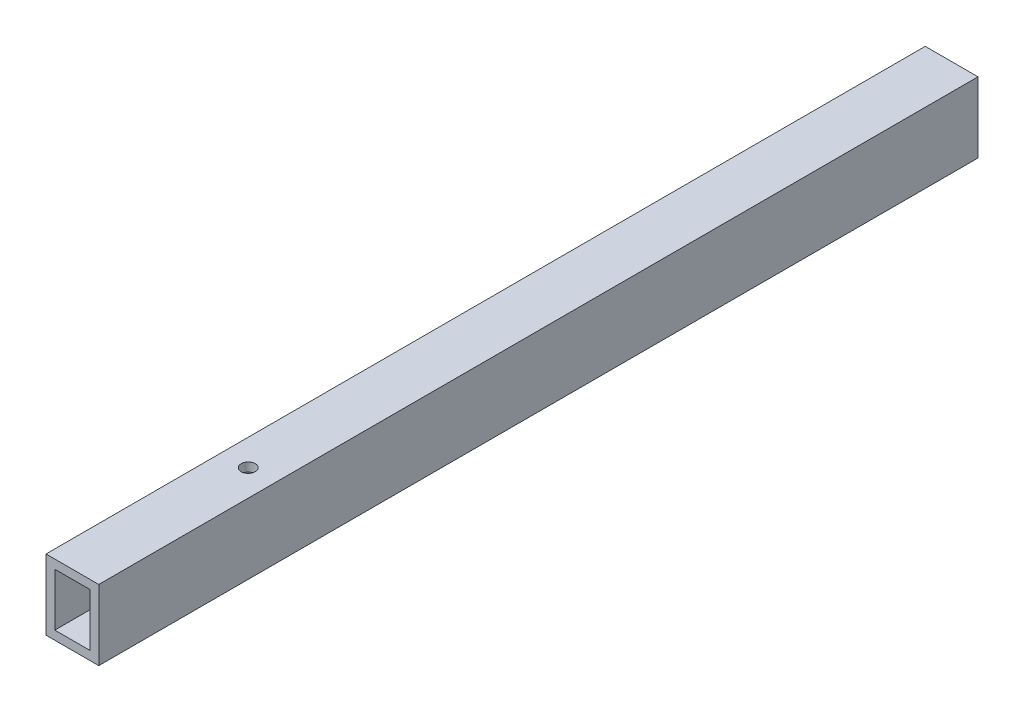
ISO-10303-21;
HEADER;
FILE_DESCRIPTION(('STEP AP214'),'2;1');
FILE_NAME('part.step','',(''),(''),'','','');
FILE_SCHEMA(('AUTOMOTIVE_DESIGN { 1 0 10303 214 1 1 1 1 }'));
ENDSEC;
DATA;
#1=APPLICATION_CONTEXT('core data for automotive mechanical design processes');
#2=APPLICATION_PROTOCOL_DEFINITION('international standard','automotive_design',2000,#1);
#3=PRODUCT_CONTEXT('',#1,'mechanical');
#4=PRODUCT('Part','Part','',(#3));
#5=PRODUCT_RELATED_PRODUCT_CATEGORY('part','',(#4));
#6=PRODUCT_DEFINITION_FORMATION('','',#4);
#7=PRODUCT_DEFINITION_CONTEXT('part definition',#1,'design');
#8=PRODUCT_DEFINITION('design','',#6,#7);
#9=PRODUCT_DEFINITION_SHAPE('','',#8);
#10=(LENGTH_UNIT() NAMED_UNIT(*) SI_UNIT(.MILLI.,.METRE.));
#11=(NAMED_UNIT(*) PLANE_ANGLE_UNIT() SI_UNIT($,.RADIAN.));
#12=(NAMED_UNIT(*) SI_UNIT($,.STERADIAN.) SOLID_ANGLE_UNIT());
#13=UNCERTAINTY_MEASURE_WITH_UNIT(LENGTH_MEASURE(1.E-05),#10,'distance_accuracy_value','');
#14=(GEOMETRIC_REPRESENTATION_CONTEXT(3) GLOBAL_UNCERTAINTY_ASSIGNED_CONTEXT((#13)) GLOBAL_UNIT_ASSIGNED_CONTEXT((#10,
#11,#12)) REPRESENTATION_CONTEXT('',''));
#15=CARTESIAN_POINT('',(0.,0.,0.));
#16=DIRECTION('',(0.,0.,1.));
#17=DIRECTION('',(1.,0.,0.));
#18=AXIS2_PLACEMENT_3D('',#15,#16,#17);
#19=CARTESIAN_POINT('',(0.,0.,-100.));
#20=DIRECTION('',(-1.,0.,0.));
#21=DIRECTION('',(0.,0.,1.));
#22=AXIS2_PLACEMENT_3D('',#19,#20,#21);
#23=PLANE('',#22);
#24=DIRECTION('',(0.,-1.,0.));
#25=VECTOR('',#24,1.);
#26=CARTESIAN_POINT('',(0.,0.,0.));
#27=LINE('',#26,#25);
#28=CARTESIAN_POINT('',(0.,8.,0.));
#29=VERTEX_POINT('',#28);
#30=CARTESIAN_POINT('',(0.,0.,0.));
#31=VERTEX_POINT('',#30);
#32=EDGE_CURVE('E156',#29,#31,#27,.T.);
#33=ORIENTED_EDGE('',*,*,#32,.F.);
#34=DIRECTION('',(0.,0.,1.));
#35=VECTOR('',#34,1.);
#36=CARTESIAN_POINT('',(0.,8.,-100.));
#37=LINE('',#36,#35);
#38=CARTESIAN_POINT('',(0.,8.,-100.));
#39=VERTEX_POINT('',#38);
#40=EDGE_CURVE('E11',#39,#29,#37,.T.);
#41=ORIENTED_EDGE('',*,*,#40,.F.);
#42=DIRECTION('',(0.,-1.,0.));
#43=VECTOR('',#42,1.);
#44=CARTESIAN_POINT('',(0.,0.,-100.));
#45=LINE('',#44,#43);
#46=CARTESIAN_POINT('',(0.,0.,-100.));
#47=VERTEX_POINT('',#46);
#48=EDGE_CURVE('E162',#39,#47,#45,.T.);
#49=ORIENTED_EDGE('',*,*,#48,.T.);
#50=DIRECTION('',(0.,0.,1.));
#51=VECTOR('',#50,1.);
#52=CARTESIAN_POINT('',(0.,0.,-100.));
#53=LINE('',#52,#51);
#54=EDGE_CURVE('E40',#47,#31,#53,.T.);
#55=ORIENTED_EDGE('',*,*,#54,.T.);
#56=EDGE_LOOP('',(#33,#41,#49,#55));
#57=FACE_BOUND('',#56,.T.);
#58=ADVANCED_FACE('F37',(#57),#23,.T.);
#59=CARTESIAN_POINT('',(0.,8.,-100.));
#60=DIRECTION('',(0.,1.,0.));
#61=DIRECTION('',(0.,0.,1.));
#62=AXIS2_PLACEMENT_3D('',#59,#60,#61);
#63=PLANE('',#62);
#64=CARTESIAN_POINT('',(3.,8.,-20.));
#65=DIRECTION('',(0.,1.,0.));
#66=DIRECTION('',(0.,0.,1.));
#67=AXIS2_PLACEMENT_3D('',#64,#65,#66);
#68=CIRCLE('',#67,0.799999999999999);
#69=CARTESIAN_POINT('',(3.,8.,-19.2));
#70=VERTEX_POINT('',#69);
#71=EDGE_CURVE('E120',#70,#70,#68,.T.);
#72=ORIENTED_EDGE('',*,*,#71,.F.);
#73=EDGE_LOOP('',(#72));
#74=FACE_BOUND('',#73,.T.);
#75=DIRECTION('',(-1.,0.,0.));
#76=VECTOR('',#75,1.);
#77=CARTESIAN_POINT('',(0.,8.,0.));
#78=LINE('',#77,#76);
#79=CARTESIAN_POINT('',(6.,8.,0.));
#80=VERTEX_POINT('',#79);
#81=EDGE_CURVE('E165',#80,#29,#78,.T.);
#82=ORIENTED_EDGE('',*,*,#81,.F.);
#83=DIRECTION('',(0.,0.,1.));
#84=VECTOR('',#83,1.);
#85=CARTESIAN_POINT('',(6.,8.,-100.));
#86=LINE('',#85,#84);
#87=CARTESIAN_POINT('',(6.,8.,-100.));
#88=VERTEX_POINT('',#87);
#89=EDGE_CURVE('E45',#88,#80,#86,.T.);
#90=ORIENTED_EDGE('',*,*,#89,.F.);
#91=DIRECTION('',(-1.,0.,0.));
#92=VECTOR('',#91,1.);
#93=CARTESIAN_POINT('',(0.,8.,-100.));
#94=LINE('',#93,#92);
#95=EDGE_CURVE('E170',#88,#39,#94,.T.);
#96=ORIENTED_EDGE('',*,*,#95,.T.);
#97=ORIENTED_EDGE('',*,*,#40,.T.);
#98=EDGE_LOOP('',(#82,#90,#96,#97));
#99=FACE_BOUND('',#98,.T.);
#100=ADVANCED_FACE('F187',(#74,#99),#63,.T.);
#101=CARTESIAN_POINT('',(6.,0.,-100.));
#102=DIRECTION('',(1.,0.,0.));
#103=DIRECTION('',(0.,0.,-1.));
#104=AXIS2_PLACEMENT_3D('',#101,#102,#103);
#105=PLANE('',#104);
#106=DIRECTION('',(0.,1.,0.));
#107=VECTOR('',#106,1.);
#108=CARTESIAN_POINT('',(6.,0.,0.));
#109=LINE('',#108,#107);
#110=CARTESIAN_POINT('',(6.,0.,0.));
#111=VERTEX_POINT('',#110);
#112=EDGE_CURVE('E177',#111,#80,#109,.T.);
#113=ORIENTED_EDGE('',*,*,#112,.F.);
#114=DIRECTION('',(0.,0.,1.));
#115=VECTOR('',#114,1.);
#116=CARTESIAN_POINT('',(6.,0.,-100.));
#117=LINE('',#116,#115);
#118=CARTESIAN_POINT('',(6.,0.,-100.));
#119=VERTEX_POINT('',#118);
#120=EDGE_CURVE('E182',#119,#111,#117,.T.);
#121=ORIENTED_EDGE('',*,*,#120,.F.);
#122=DIRECTION('',(0.,1.,0.));
#123=VECTOR('',#122,1.);
#124=CARTESIAN_POINT('',(6.,0.,-100.));
#125=LINE('',#124,#123);
#126=EDGE_CURVE('E167',#119,#88,#125,.T.);
#127=ORIENTED_EDGE('',*,*,#126,.T.);
#128=ORIENTED_EDGE('',*,*,#89,.T.);
#129=EDGE_LOOP('',(#113,#121,#127,#128));
#130=FACE_BOUND('',#129,.T.);
#131=ADVANCED_FACE('F191',(#130),#105,.T.);
#132=CARTESIAN_POINT('',(0.,0.,-100.));
#133=DIRECTION('',(0.,-1.,0.));
#134=DIRECTION('',(0.,0.,-1.));
#135=AXIS2_PLACEMENT_3D('',#132,#133,#134);
#136=PLANE('',#135);
#137=DIRECTION('',(1.,0.,0.));
#138=VECTOR('',#137,1.);
#139=CARTESIAN_POINT('',(0.,0.,0.));
#140=LINE('',#139,#138);
#141=EDGE_CURVE('E174',#31,#111,#140,.T.);
#142=ORIENTED_EDGE('',*,*,#141,.F.);
#143=ORIENTED_EDGE('',*,*,#54,.F.);
#144=DIRECTION('',(1.,0.,0.));
#145=VECTOR('',#144,1.);
#146=CARTESIAN_POINT('',(0.,0.,-100.));
#147=LINE('',#146,#145);
#148=EDGE_CURVE('E164',#47,#119,#147,.T.);
#149=ORIENTED_EDGE('',*,*,#148,.T.);
#150=ORIENTED_EDGE('',*,*,#120,.T.);
#151=EDGE_LOOP('',(#142,#143,#149,#150));
#152=FACE_BOUND('',#151,.T.);
#153=ADVANCED_FACE('F184',(#152),#136,.T.);
#154=CARTESIAN_POINT('',(0.,0.,-100.));
#155=DIRECTION('',(0.,0.,-1.));
#156=DIRECTION('',(-1.,0.,0.));
#157=AXIS2_PLACEMENT_3D('',#154,#155,#156);
#158=PLANE('',#157);
#159=CARTESIAN_POINT('',(3.,4.,-100.));
#160=DIRECTION('',(0.,0.,-1.));
#161=DIRECTION('',(-1.,0.,0.));
#162=AXIS2_PLACEMENT_3D('',#159,#160,#161);
#163=CIRCLE('',#162,1.25);
#164=CARTESIAN_POINT('',(1.75,4.,-100.));
#165=VERTEX_POINT('',#164);
#166=EDGE_CURVE('E121',#165,#165,#163,.T.);
#167=ORIENTED_EDGE('',*,*,#166,.F.);
#168=EDGE_LOOP('',(#167));
#169=FACE_BOUND('',#168,.T.);
#170=ORIENTED_EDGE('',*,*,#48,.F.);
#171=ORIENTED_EDGE('',*,*,#95,.F.);
#172=ORIENTED_EDGE('',*,*,#126,.F.);
#173=ORIENTED_EDGE('',*,*,#148,.F.);
#174=EDGE_LOOP('',(#170,#171,#172,#173));
#175=FACE_BOUND('',#174,.T.);
#176=ADVANCED_FACE('F193',(#169,#175),#158,.T.);
#177=CARTESIAN_POINT('',(0.,0.,0.));
#178=DIRECTION('',(0.,0.,-1.));
#179=DIRECTION('',(-1.,0.,0.));
#180=AXIS2_PLACEMENT_3D('',#177,#178,#179);
#181=PLANE('',#180);
#182=DIRECTION('',(1.,0.,0.));
#183=VECTOR('',#182,1.);
#184=CARTESIAN_POINT('',(1.,1.,0.));
#185=LINE('',#184,#183);
#186=CARTESIAN_POINT('',(1.,1.,0.));
#187=VERTEX_POINT('',#186);
#188=CARTESIAN_POINT('',(5.,1.,0.));
#189=VERTEX_POINT('',#188);
#190=EDGE_CURVE('E146',#187,#189,#185,.T.);
#191=ORIENTED_EDGE('',*,*,#190,.F.);
#192=DIRECTION('',(0.,-1.,0.));
#193=VECTOR('',#192,1.);
#194=CARTESIAN_POINT('',(1.,7.,0.));
#195=LINE('',#194,#193);
#196=CARTESIAN_POINT('',(1.,7.,0.));
#197=VERTEX_POINT('',#196);
#198=EDGE_CURVE('E53',#197,#187,#195,.T.);
#199=ORIENTED_EDGE('',*,*,#198,.F.);
#200=DIRECTION('',(-1.,0.,0.));
#201=VECTOR('',#200,1.);
#202=CARTESIAN_POINT('',(1.,7.,0.));
#203=LINE('',#202,#201);
#204=CARTESIAN_POINT('',(5.,7.,0.));
#205=VERTEX_POINT('',#204);
#206=EDGE_CURVE('E135',#205,#197,#203,.T.);
#207=ORIENTED_EDGE('',*,*,#206,.F.);
#208=DIRECTION('',(0.,1.,0.));
#209=VECTOR('',#208,1.);
#210=CARTESIAN_POINT('',(5.,7.,0.));
#211=LINE('',#210,#209);
#212=EDGE_CURVE('E149',#189,#205,#211,.T.);
#213=ORIENTED_EDGE('',*,*,#212,.F.);
#214=EDGE_LOOP('',(#191,#199,#207,#213));
#215=FACE_BOUND('',#214,.T.);
#216=ORIENTED_EDGE('',*,*,#32,.T.);
#217=ORIENTED_EDGE('',*,*,#141,.T.);
#218=ORIENTED_EDGE('',*,*,#112,.T.);
#219=ORIENTED_EDGE('',*,*,#81,.T.);
#220=EDGE_LOOP('',(#216,#217,#218,#219));
#221=FACE_BOUND('',#220,.T.);
#222=ADVANCED_FACE('F186',(#215,#221),#181,.F.);
#223=CARTESIAN_POINT('',(1.,7.,-80.));
#224=DIRECTION('',(-1.,0.,0.));
#225=DIRECTION('',(0.,-1.,0.));
#226=AXIS2_PLACEMENT_3D('',#223,#224,#225);
#227=PLANE('',#226);
#228=ORIENTED_EDGE('',*,*,#198,.T.);
#229=DIRECTION('',(0.,0.,1.));
#230=VECTOR('',#229,1.);
#231=CARTESIAN_POINT('',(1.,1.,-80.));
#232=LINE('',#231,#230);
#233=CARTESIAN_POINT('',(1.,1.,-80.));
#234=VERTEX_POINT('',#233);
#235=EDGE_CURVE('E144',#234,#187,#232,.T.);
#236=ORIENTED_EDGE('',*,*,#235,.F.);
#237=DIRECTION('',(0.,-1.,0.));
#238=VECTOR('',#237,1.);
#239=CARTESIAN_POINT('',(1.,7.,-80.));
#240=LINE('',#239,#238);
#241=CARTESIAN_POINT('',(1.,7.,-80.));
#242=VERTEX_POINT('',#241);
#243=EDGE_CURVE('E131',#242,#234,#240,.T.);
#244=ORIENTED_EDGE('',*,*,#243,.F.);
#245=DIRECTION('',(0.,0.,1.));
#246=VECTOR('',#245,1.);
#247=CARTESIAN_POINT('',(1.,7.,-80.));
#248=LINE('',#247,#246);
#249=EDGE_CURVE('E154',#242,#197,#248,.T.);
#250=ORIENTED_EDGE('',*,*,#249,.T.);
#251=EDGE_LOOP('',(#228,#236,#244,#250));
#252=FACE_BOUND('',#251,.T.);
#253=ADVANCED_FACE('F201',(#252),#227,.F.);
#254=CARTESIAN_POINT('',(1.,7.,-80.));
#255=DIRECTION('',(0.,1.,0.));
#256=DIRECTION('',(0.,0.,1.));
#257=AXIS2_PLACEMENT_3D('',#254,#255,#256);
#258=PLANE('',#257);
#259=CARTESIAN_POINT('',(3.,7.,-20.));
#260=DIRECTION('',(0.,1.,0.));
#261=DIRECTION('',(0.,0.,1.));
#262=AXIS2_PLACEMENT_3D('',#259,#260,#261);
#263=CIRCLE('',#262,0.799999999999999);
#264=CARTESIAN_POINT('',(3.,7.,-19.2));
#265=VERTEX_POINT('',#264);
#266=EDGE_CURVE('E124',#265,#265,#263,.T.);
#267=ORIENTED_EDGE('',*,*,#266,.T.);
#268=EDGE_LOOP('',(#267));
#269=FACE_BOUND('',#268,.T.);
#270=ORIENTED_EDGE('',*,*,#206,.T.);
#271=ORIENTED_EDGE('',*,*,#249,.F.);
#272=DIRECTION('',(-1.,0.,0.));
#273=VECTOR('',#272,1.);
#274=CARTESIAN_POINT('',(1.,7.,-80.));
#275=LINE('',#274,#273);
#276=CARTESIAN_POINT('',(5.,7.,-80.));
#277=VERTEX_POINT('',#276);
#278=EDGE_CURVE('E141',#277,#242,#275,.T.);
#279=ORIENTED_EDGE('',*,*,#278,.F.);
#280=DIRECTION('',(0.,0.,1.));
#281=VECTOR('',#280,1.);
#282=CARTESIAN_POINT('',(5.,7.,-80.));
#283=LINE('',#282,#281);
#284=EDGE_CURVE('E157',#277,#205,#283,.T.);
#285=ORIENTED_EDGE('',*,*,#284,.T.);
#286=EDGE_LOOP('',(#270,#271,#279,#285));
#287=FACE_BOUND('',#286,.T.);
#288=ADVANCED_FACE('F224',(#269,#287),#258,.F.);
#289=CARTESIAN_POINT('',(5.,7.,-80.));
#290=DIRECTION('',(1.,0.,0.));
#291=DIRECTION('',(0.,1.,0.));
#292=AXIS2_PLACEMENT_3D('',#289,#290,#291);
#293=PLANE('',#292);
#294=ORIENTED_EDGE('',*,*,#212,.T.);
#295=ORIENTED_EDGE('',*,*,#284,.F.);
#296=DIRECTION('',(0.,1.,0.));
#297=VECTOR('',#296,1.);
#298=CARTESIAN_POINT('',(5.,7.,-80.));
#299=LINE('',#298,#297);
#300=CARTESIAN_POINT('',(5.,1.,-80.));
#301=VERTEX_POINT('',#300);
#302=EDGE_CURVE('E138',#301,#277,#299,.T.);
#303=ORIENTED_EDGE('',*,*,#302,.F.);
#304=DIRECTION('',(0.,0.,1.));
#305=VECTOR('',#304,1.);
#306=CARTESIAN_POINT('',(5.,1.,-80.));
#307=LINE('',#306,#305);
#308=EDGE_CURVE('E159',#301,#189,#307,.T.);
#309=ORIENTED_EDGE('',*,*,#308,.T.);
#310=EDGE_LOOP('',(#294,#295,#303,#309));
#311=FACE_BOUND('',#310,.T.);
#312=ADVANCED_FACE('F227',(#311),#293,.F.);
#313=CARTESIAN_POINT('',(1.,1.,-80.));
#314=DIRECTION('',(0.,-1.,0.));
#315=DIRECTION('',(0.,0.,-1.));
#316=AXIS2_PLACEMENT_3D('',#313,#314,#315);
#317=PLANE('',#316);
#318=ORIENTED_EDGE('',*,*,#190,.T.);
#319=ORIENTED_EDGE('',*,*,#308,.F.);
#320=DIRECTION('',(1.,0.,0.));
#321=VECTOR('',#320,1.);
#322=CARTESIAN_POINT('',(1.,1.,-80.));
#323=LINE('',#322,#321);
#324=EDGE_CURVE('E134',#234,#301,#323,.T.);
#325=ORIENTED_EDGE('',*,*,#324,.F.);
#326=ORIENTED_EDGE('',*,*,#235,.T.);
#327=EDGE_LOOP('',(#318,#319,#325,#326));
#328=FACE_BOUND('',#327,.T.);
#329=ADVANCED_FACE('F235',(#328),#317,.F.);
#330=CARTESIAN_POINT('',(0.,0.,-80.));
#331=DIRECTION('',(0.,0.,1.));
#332=DIRECTION('',(1.,0.,0.));
#333=AXIS2_PLACEMENT_3D('',#330,#331,#332);
#334=PLANE('',#333);
#335=ORIENTED_EDGE('',*,*,#243,.T.);
#336=ORIENTED_EDGE('',*,*,#324,.T.);
#337=ORIENTED_EDGE('',*,*,#302,.T.);
#338=ORIENTED_EDGE('',*,*,#278,.T.);
#339=EDGE_LOOP('',(#335,#336,#337,#338));
#340=FACE_BOUND('',#339,.T.);
#341=ADVANCED_FACE('F220',(#340),#334,.T.);
#342=CARTESIAN_POINT('',(3.,8.,-20.));
#343=DIRECTION('',(0.,1.,0.));
#344=DIRECTION('',(0.,0.,1.));
#345=AXIS2_PLACEMENT_3D('',#342,#343,#344);
#346=CYLINDRICAL_SURFACE('',#345,0.799999999999999);
#347=ORIENTED_EDGE('',*,*,#71,.T.);
#348=EDGE_LOOP('',(#347));
#349=FACE_BOUND('',#348,.T.);
#350=ORIENTED_EDGE('',*,*,#266,.F.);
#351=EDGE_LOOP('',(#350));
#352=FACE_BOUND('',#351,.T.);
#353=ADVANCED_FACE('F114',(#349,#352),#346,.F.);
#354=CARTESIAN_POINT('',(3.,4.,-90.));
#355=DIRECTION('',(0.,0.,-1.));
#356=DIRECTION('',(-1.,0.,0.));
#357=AXIS2_PLACEMENT_3D('',#354,#355,#356);
#358=CONICAL_SURFACE('',#357,1.25,1.02974425867665);
#359=CARTESIAN_POINT('',(3.,4.,-89.2489242262155));
#360=VERTEX_POINT('',#359);
#361=VERTEX_LOOP('',#360);
#362=FACE_BOUND('',#361,.T.);
#363=CARTESIAN_POINT('',(3.,4.,-90.));
#364=DIRECTION('',(0.,0.,-1.));
#365=DIRECTION('',(-1.,0.,0.));
#366=AXIS2_PLACEMENT_3D('',#363,#364,#365);
#367=CIRCLE('',#366,1.25);
#368=CARTESIAN_POINT('',(1.75,4.,-90.));
#369=VERTEX_POINT('',#368);
#370=EDGE_CURVE('E118',#369,#369,#367,.T.);
#371=ORIENTED_EDGE('',*,*,#370,.T.);
#372=EDGE_LOOP('',(#371));
#373=FACE_BOUND('',#372,.T.);
#374=ADVANCED_FACE('F110',(#362,#373),#358,.F.);
#375=CARTESIAN_POINT('',(3.,4.,-100.));
#376=DIRECTION('',(0.,0.,-1.));
#377=DIRECTION('',(-1.,0.,0.));
#378=AXIS2_PLACEMENT_3D('',#375,#376,#377);
#379=CYLINDRICAL_SURFACE('',#378,1.25);
#380=ORIENTED_EDGE('',*,*,#370,.F.);
#381=EDGE_LOOP('',(#380));
#382=FACE_BOUND('',#381,.T.);
#383=ORIENTED_EDGE('',*,*,#166,.T.);
#384=EDGE_LOOP('',(#383));
#385=FACE_BOUND('',#384,.T.);
#386=ADVANCED_FACE('F113',(#382,#385),#379,.F.);
#387=CLOSED_SHELL('',(#58,#100,#131,#153,#176,#222,#253,#288,#312,#329,#341,#353,#374,#386));
#388=MANIFOLD_SOLID_BREP('B2',#387);
#389=ADVANCED_BREP_SHAPE_REPRESENTATION('',(#18,#388),#14);
#390=SHAPE_DEFINITION_REPRESENTATION(#9,#389);
ENDSEC;
END-ISO-10303-21;
